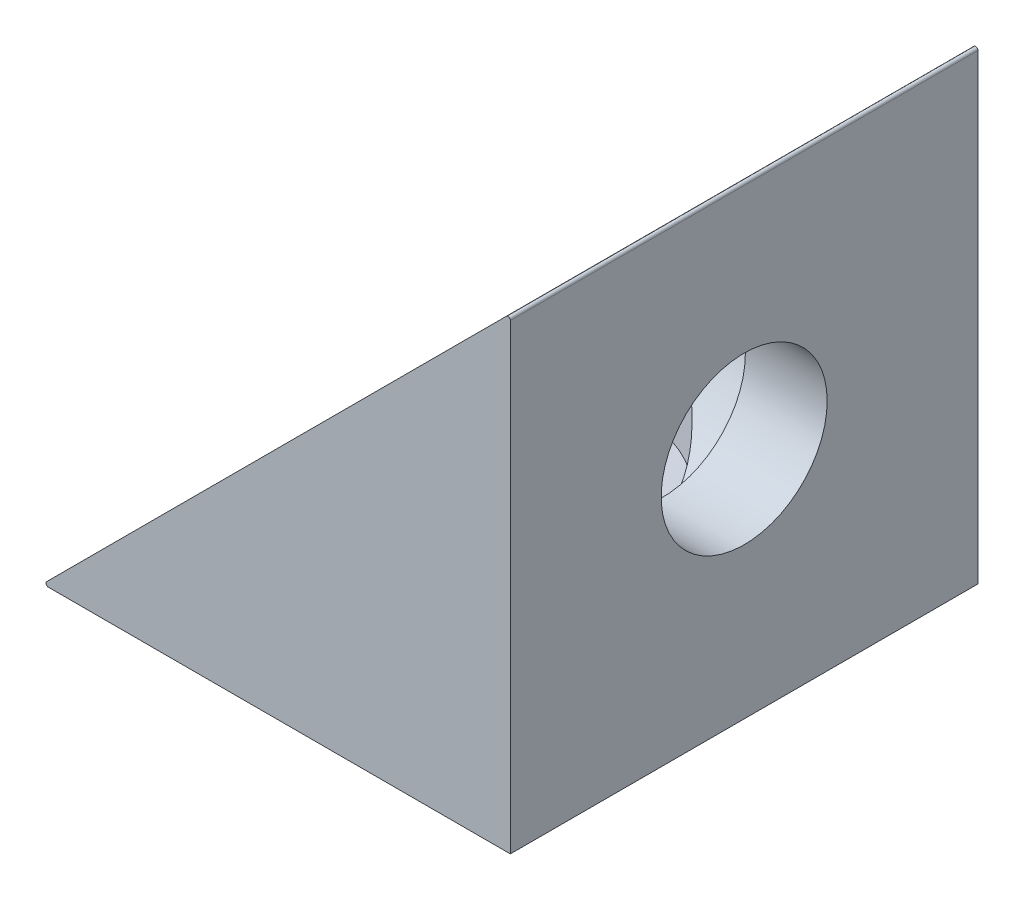
ISO-10303-21;
HEADER;
FILE_DESCRIPTION(('STEP AP214'),'2;1');
FILE_NAME('part.step','',(''),(''),'','','');
FILE_SCHEMA(('AUTOMOTIVE_DESIGN { 1 0 10303 214 1 1 1 1 }'));
ENDSEC;
DATA;
#1=APPLICATION_CONTEXT('core data for automotive mechanical design processes');
#2=APPLICATION_PROTOCOL_DEFINITION('international standard','automotive_design',2000,#1);
#3=PRODUCT_CONTEXT('',#1,'mechanical');
#4=PRODUCT('Part','Part','',(#3));
#5=PRODUCT_RELATED_PRODUCT_CATEGORY('part','',(#4));
#6=PRODUCT_DEFINITION_FORMATION('','',#4);
#7=PRODUCT_DEFINITION_CONTEXT('part definition',#1,'design');
#8=PRODUCT_DEFINITION('design','',#6,#7);
#9=PRODUCT_DEFINITION_SHAPE('','',#8);
#10=(LENGTH_UNIT() NAMED_UNIT(*) SI_UNIT(.MILLI.,.METRE.));
#11=(NAMED_UNIT(*) PLANE_ANGLE_UNIT() SI_UNIT($,.RADIAN.));
#12=(NAMED_UNIT(*) SI_UNIT($,.STERADIAN.) SOLID_ANGLE_UNIT());
#13=UNCERTAINTY_MEASURE_WITH_UNIT(LENGTH_MEASURE(1.E-05),#10,'distance_accuracy_value','');
#14=(GEOMETRIC_REPRESENTATION_CONTEXT(3) GLOBAL_UNCERTAINTY_ASSIGNED_CONTEXT((#13)) GLOBAL_UNIT_ASSIGNED_CONTEXT((#10,
#11,#12)) REPRESENTATION_CONTEXT('',''));
#15=CARTESIAN_POINT('',(0.,0.,0.));
#16=DIRECTION('',(0.,0.,1.));
#17=DIRECTION('',(1.,0.,0.));
#18=AXIS2_PLACEMENT_3D('',#15,#16,#17);
#19=CARTESIAN_POINT('',(0.,-20.,20.));
#20=DIRECTION('',(-1.,0.,0.));
#21=DIRECTION('',(0.,0.,1.));
#22=AXIS2_PLACEMENT_3D('',#19,#20,#21);
#23=PLANE('',#22);
#24=CARTESIAN_POINT('',(0.,-10.,10.));
#25=DIRECTION('',(1.,0.,0.));
#26=DIRECTION('',(0.,0.,-1.));
#27=AXIS2_PLACEMENT_3D('',#24,#25,#26);
#28=CIRCLE('',#27,3.55);
#29=CARTESIAN_POINT('',(0.,-10.,6.45));
#30=VERTEX_POINT('',#29);
#31=EDGE_CURVE('E106',#30,#30,#28,.T.);
#32=ORIENTED_EDGE('',*,*,#31,.F.);
#33=EDGE_LOOP('',(#32));
#34=FACE_BOUND('',#33,.T.);
#35=DIRECTION('',(0.,1.,0.));
#36=VECTOR('',#35,1.);
#37=CARTESIAN_POINT('',(0.,-20.,0.));
#38=LINE('',#37,#36);
#39=CARTESIAN_POINT('',(0.,-20.,0.));
#40=VERTEX_POINT('',#39);
#41=CARTESIAN_POINT('',(0.,-0.241421356237306,0.));
#42=VERTEX_POINT('',#41);
#43=EDGE_CURVE('E116',#40,#42,#38,.T.);
#44=ORIENTED_EDGE('',*,*,#43,.T.);
#45=DIRECTION('',(0.,0.,-1.));
#46=VECTOR('',#45,1.);
#47=CARTESIAN_POINT('',(0.,-0.241421356237306,20.));
#48=LINE('',#47,#46);
#49=CARTESIAN_POINT('',(0.,-0.241421356237306,20.));
#50=VERTEX_POINT('',#49);
#51=EDGE_CURVE('E11',#42,#50,#48,.F.);
#52=ORIENTED_EDGE('',*,*,#51,.T.);
#53=DIRECTION('',(0.,1.,0.));
#54=VECTOR('',#53,1.);
#55=CARTESIAN_POINT('',(0.,-20.,20.));
#56=LINE('',#55,#54);
#57=CARTESIAN_POINT('',(0.,-20.,20.));
#58=VERTEX_POINT('',#57);
#59=EDGE_CURVE('E117',#58,#50,#56,.T.);
#60=ORIENTED_EDGE('',*,*,#59,.F.);
#61=DIRECTION('',(0.,0.,-1.));
#62=VECTOR('',#61,1.);
#63=CARTESIAN_POINT('',(0.,-20.,20.));
#64=LINE('',#63,#62);
#65=EDGE_CURVE('E98',#58,#40,#64,.T.);
#66=ORIENTED_EDGE('',*,*,#65,.T.);
#67=EDGE_LOOP('',(#44,#52,#60,#66));
#68=FACE_BOUND('',#67,.T.);
#69=ADVANCED_FACE('F36',(#34,#68),#23,.F.);
#70=CARTESIAN_POINT('',(-20.,-20.,20.));
#71=DIRECTION('',(0.707106781186548,-0.707106781186548,0.));
#72=DIRECTION('',(0.707106781186548,0.707106781186548,0.));
#73=AXIS2_PLACEMENT_3D('',#70,#71,#72);
#74=PLANE('',#73);
#75=CARTESIAN_POINT('',(-10.,-10.,10.));
#76=DIRECTION('',(0.707106781186548,-0.707106781186548,0.));
#77=DIRECTION('',(0.707106781186548,0.707106781186548,0.));
#78=AXIS2_PLACEMENT_3D('',#75,#76,#77);
#79=ELLIPSE('',#78,7.77817459305202,5.5);
#80=CARTESIAN_POINT('',(-10.,-10.,15.5));
#81=VERTEX_POINT('',#80);
#82=CARTESIAN_POINT('',(-10.,-10.,4.5));
#83=VERTEX_POINT('',#82);
#84=EDGE_CURVE('E94',#81,#83,#79,.T.);
#85=ORIENTED_EDGE('',*,*,#84,.T.);
#86=EDGE_CURVE('E100',#83,#81,#79,.T.);
#87=ORIENTED_EDGE('',*,*,#86,.T.);
#88=EDGE_LOOP('',(#85,#87));
#89=FACE_BOUND('',#88,.T.);
#90=DIRECTION('',(-0.707106781186548,-0.707106781186548,0.));
#91=VECTOR('',#90,1.);
#92=CARTESIAN_POINT('',(-20.,-20.,0.));
#93=LINE('',#92,#91);
#94=CARTESIAN_POINT('',(-0.170710678118653,-0.170710678118653,0.));
#95=VERTEX_POINT('',#94);
#96=CARTESIAN_POINT('',(-19.8292893218813,-19.8292893218813,0.));
#97=VERTEX_POINT('',#96);
#98=EDGE_CURVE('E125',#95,#97,#93,.T.);
#99=ORIENTED_EDGE('',*,*,#98,.T.);
#100=DIRECTION('',(0.,0.,-1.));
#101=VECTOR('',#100,1.);
#102=CARTESIAN_POINT('',(-19.8292893218813,-19.8292893218813,20.));
#103=LINE('',#102,#101);
#104=CARTESIAN_POINT('',(-19.8292893218813,-19.8292893218813,20.));
#105=VERTEX_POINT('',#104);
#106=EDGE_CURVE('E57',#97,#105,#103,.F.);
#107=ORIENTED_EDGE('',*,*,#106,.T.);
#108=DIRECTION('',(-0.707106781186548,-0.707106781186548,0.));
#109=VECTOR('',#108,1.);
#110=CARTESIAN_POINT('',(-20.,-20.,20.));
#111=LINE('',#110,#109);
#112=CARTESIAN_POINT('',(-0.170710678118653,-0.170710678118653,20.));
#113=VERTEX_POINT('',#112);
#114=EDGE_CURVE('E119',#113,#105,#111,.T.);
#115=ORIENTED_EDGE('',*,*,#114,.F.);
#116=DIRECTION('',(0.,0.,-1.));
#117=VECTOR('',#116,1.);
#118=CARTESIAN_POINT('',(-0.170710678118656,-0.170710678118656,20.));
#119=LINE('',#118,#117);
#120=EDGE_CURVE('E142',#113,#95,#119,.T.);
#121=ORIENTED_EDGE('',*,*,#120,.T.);
#122=EDGE_LOOP('',(#99,#107,#115,#121));
#123=FACE_BOUND('',#122,.T.);
#124=ADVANCED_FACE('F105',(#89,#123),#74,.F.);
#125=CARTESIAN_POINT('',(-20.,-20.,20.));
#126=DIRECTION('',(0.,1.,0.));
#127=DIRECTION('',(0.,0.,1.));
#128=AXIS2_PLACEMENT_3D('',#125,#126,#127);
#129=PLANE('',#128);
#130=CARTESIAN_POINT('',(-10.,-20.,10.));
#131=DIRECTION('',(0.,-1.,0.));
#132=DIRECTION('',(0.,0.,-1.));
#133=AXIS2_PLACEMENT_3D('',#130,#131,#132);
#134=CIRCLE('',#133,3.55);
#135=CARTESIAN_POINT('',(-10.,-20.,6.45));
#136=VERTEX_POINT('',#135);
#137=EDGE_CURVE('E108',#136,#136,#134,.T.);
#138=ORIENTED_EDGE('',*,*,#137,.F.);
#139=EDGE_LOOP('',(#138));
#140=FACE_BOUND('',#139,.T.);
#141=DIRECTION('',(1.,0.,0.));
#142=VECTOR('',#141,1.);
#143=CARTESIAN_POINT('',(-20.,-20.,20.));
#144=LINE('',#143,#142);
#145=CARTESIAN_POINT('',(-19.7585786437627,-20.,20.));
#146=VERTEX_POINT('',#145);
#147=EDGE_CURVE('E122',#146,#58,#144,.T.);
#148=ORIENTED_EDGE('',*,*,#147,.F.);
#149=DIRECTION('',(0.,0.,-1.));
#150=VECTOR('',#149,1.);
#151=CARTESIAN_POINT('',(-19.7585786437627,-20.,20.));
#152=LINE('',#151,#150);
#153=CARTESIAN_POINT('',(-19.7585786437627,-20.,0.));
#154=VERTEX_POINT('',#153);
#155=EDGE_CURVE('E97',#146,#154,#152,.T.);
#156=ORIENTED_EDGE('',*,*,#155,.T.);
#157=DIRECTION('',(1.,0.,0.));
#158=VECTOR('',#157,1.);
#159=CARTESIAN_POINT('',(-20.,-20.,0.));
#160=LINE('',#159,#158);
#161=EDGE_CURVE('E120',#154,#40,#160,.T.);
#162=ORIENTED_EDGE('',*,*,#161,.T.);
#163=ORIENTED_EDGE('',*,*,#65,.F.);
#164=EDGE_LOOP('',(#148,#156,#162,#163));
#165=FACE_BOUND('',#164,.T.);
#166=ADVANCED_FACE('F155',(#140,#165),#129,.F.);
#167=CARTESIAN_POINT('',(0.,0.,20.));
#168=DIRECTION('',(0.,0.,-1.));
#169=DIRECTION('',(-1.,0.,0.));
#170=AXIS2_PLACEMENT_3D('',#167,#168,#169);
#171=PLANE('',#170);
#172=ORIENTED_EDGE('',*,*,#114,.T.);
#173=CARTESIAN_POINT('',(-19.7585786437627,-19.9,20.));
#174=DIRECTION('',(0.,0.,-1.));
#175=DIRECTION('',(-1.,0.,0.));
#176=AXIS2_PLACEMENT_3D('',#173,#174,#175);
#177=CIRCLE('',#176,0.1);
#178=EDGE_CURVE('E44',#105,#146,#177,.F.);
#179=ORIENTED_EDGE('',*,*,#178,.T.);
#180=ORIENTED_EDGE('',*,*,#147,.T.);
#181=ORIENTED_EDGE('',*,*,#59,.T.);
#182=CARTESIAN_POINT('',(-0.0999999999999994,-0.241421356237306,20.));
#183=DIRECTION('',(0.,0.,-1.));
#184=DIRECTION('',(-1.,0.,0.));
#185=AXIS2_PLACEMENT_3D('',#182,#183,#184);
#186=CIRCLE('',#185,0.1);
#187=EDGE_CURVE('E146',#50,#113,#186,.F.);
#188=ORIENTED_EDGE('',*,*,#187,.T.);
#189=EDGE_LOOP('',(#172,#179,#180,#181,#188));
#190=FACE_BOUND('',#189,.T.);
#191=ADVANCED_FACE('F150',(#190),#171,.F.);
#192=CARTESIAN_POINT('',(0.,0.,0.));
#193=DIRECTION('',(0.,0.,-1.));
#194=DIRECTION('',(-1.,0.,0.));
#195=AXIS2_PLACEMENT_3D('',#192,#193,#194);
#196=PLANE('',#195);
#197=ORIENTED_EDGE('',*,*,#161,.F.);
#198=CARTESIAN_POINT('',(-19.7585786437627,-19.9,0.));
#199=DIRECTION('',(0.,0.,-1.));
#200=DIRECTION('',(-1.,0.,0.));
#201=AXIS2_PLACEMENT_3D('',#198,#199,#200);
#202=CIRCLE('',#201,0.1);
#203=EDGE_CURVE('E140',#154,#97,#202,.T.);
#204=ORIENTED_EDGE('',*,*,#203,.T.);
#205=ORIENTED_EDGE('',*,*,#98,.F.);
#206=CARTESIAN_POINT('',(-0.0999999999999994,-0.241421356237306,0.));
#207=DIRECTION('',(0.,0.,-1.));
#208=DIRECTION('',(-1.,0.,0.));
#209=AXIS2_PLACEMENT_3D('',#206,#207,#208);
#210=CIRCLE('',#209,0.1);
#211=EDGE_CURVE('E138',#95,#42,#210,.T.);
#212=ORIENTED_EDGE('',*,*,#211,.T.);
#213=ORIENTED_EDGE('',*,*,#43,.F.);
#214=EDGE_LOOP('',(#197,#204,#205,#212,#213));
#215=FACE_BOUND('',#214,.T.);
#216=ADVANCED_FACE('F160',(#215),#196,.T.);
#217=CARTESIAN_POINT('',(-10.,0.,10.));
#218=DIRECTION('',(0.,-1.,0.));
#219=DIRECTION('',(0.,0.,-1.));
#220=AXIS2_PLACEMENT_3D('',#217,#218,#219);
#221=CYLINDRICAL_SURFACE('',#220,3.55);
#222=CARTESIAN_POINT('',(-10.,-16.5,10.));
#223=DIRECTION('',(0.,-1.,0.));
#224=DIRECTION('',(0.,0.,-1.));
#225=AXIS2_PLACEMENT_3D('',#222,#223,#224);
#226=CIRCLE('',#225,3.55);
#227=CARTESIAN_POINT('',(-10.,-16.5,6.45));
#228=VERTEX_POINT('',#227);
#229=EDGE_CURVE('E132',#228,#228,#226,.F.);
#230=ORIENTED_EDGE('',*,*,#229,.T.);
#231=EDGE_LOOP('',(#230));
#232=FACE_BOUND('',#231,.T.);
#233=ORIENTED_EDGE('',*,*,#137,.T.);
#234=EDGE_LOOP('',(#233));
#235=FACE_BOUND('',#234,.T.);
#236=ADVANCED_FACE('F199',(#232,#235),#221,.F.);
#237=CARTESIAN_POINT('',(-20.,-10.,10.));
#238=DIRECTION('',(1.,0.,0.));
#239=DIRECTION('',(0.,0.,-1.));
#240=AXIS2_PLACEMENT_3D('',#237,#238,#239);
#241=CYLINDRICAL_SURFACE('',#240,3.55);
#242=CARTESIAN_POINT('',(-3.5,-10.,10.));
#243=DIRECTION('',(1.,0.,0.));
#244=DIRECTION('',(0.,0.,-1.));
#245=AXIS2_PLACEMENT_3D('',#242,#243,#244);
#246=CIRCLE('',#245,3.55);
#247=CARTESIAN_POINT('',(-3.5,-10.,6.45));
#248=VERTEX_POINT('',#247);
#249=EDGE_CURVE('E103',#248,#248,#246,.F.);
#250=ORIENTED_EDGE('',*,*,#249,.T.);
#251=EDGE_LOOP('',(#250));
#252=FACE_BOUND('',#251,.T.);
#253=ORIENTED_EDGE('',*,*,#31,.T.);
#254=EDGE_LOOP('',(#253));
#255=FACE_BOUND('',#254,.T.);
#256=ADVANCED_FACE('F195',(#252,#255),#241,.F.);
#257=CARTESIAN_POINT('',(-20.,-10.,10.));
#258=DIRECTION('',(1.,0.,0.));
#259=DIRECTION('',(0.,0.,-1.));
#260=AXIS2_PLACEMENT_3D('',#257,#258,#259);
#261=CYLINDRICAL_SURFACE('',#260,5.5);
#262=CARTESIAN_POINT('',(-3.5,-10.,10.));
#263=DIRECTION('',(1.,0.,0.));
#264=DIRECTION('',(0.,0.,-1.));
#265=AXIS2_PLACEMENT_3D('',#262,#263,#264);
#266=CIRCLE('',#265,5.5);
#267=CARTESIAN_POINT('',(-3.5,-10.,4.5));
#268=VERTEX_POINT('',#267);
#269=EDGE_CURVE('E111',#268,#268,#266,.T.);
#270=ORIENTED_EDGE('',*,*,#269,.T.);
#271=EDGE_LOOP('',(#270));
#272=FACE_BOUND('',#271,.T.);
#273=ORIENTED_EDGE('',*,*,#86,.F.);
#274=CARTESIAN_POINT('',(-10.,-10.,10.));
#275=DIRECTION('',(0.707106781186547,0.707106781186547,0.));
#276=DIRECTION('',(0.707106781186547,-0.707106781186547,0.));
#277=AXIS2_PLACEMENT_3D('',#274,#275,#276);
#278=ELLIPSE('',#277,7.77817459305202,5.5);
#279=EDGE_CURVE('E90',#83,#81,#278,.F.);
#280=ORIENTED_EDGE('',*,*,#279,.T.);
#281=EDGE_LOOP('',(#273,#280));
#282=FACE_BOUND('',#281,.T.);
#283=ADVANCED_FACE('F101',(#272,#282),#261,.F.);
#284=CARTESIAN_POINT('',(-3.5,-10.,10.));
#285=DIRECTION('',(1.,0.,0.));
#286=DIRECTION('',(0.,0.,-1.));
#287=AXIS2_PLACEMENT_3D('',#284,#285,#286);
#288=PLANE('',#287);
#289=ORIENTED_EDGE('',*,*,#269,.F.);
#290=EDGE_LOOP('',(#289));
#291=FACE_BOUND('',#290,.T.);
#292=ORIENTED_EDGE('',*,*,#249,.F.);
#293=EDGE_LOOP('',(#292));
#294=FACE_BOUND('',#293,.T.);
#295=ADVANCED_FACE('F185',(#291,#294),#288,.F.);
#296=CARTESIAN_POINT('',(-10.,-16.5,10.));
#297=DIRECTION('',(0.,-1.,0.));
#298=DIRECTION('',(0.,0.,-1.));
#299=AXIS2_PLACEMENT_3D('',#296,#297,#298);
#300=PLANE('',#299);
#301=CARTESIAN_POINT('',(-10.,-16.5,10.));
#302=DIRECTION('',(0.,-1.,0.));
#303=DIRECTION('',(0.,0.,-1.));
#304=AXIS2_PLACEMENT_3D('',#301,#302,#303);
#305=CIRCLE('',#304,5.5);
#306=CARTESIAN_POINT('',(-10.,-16.5,4.5));
#307=VERTEX_POINT('',#306);
#308=EDGE_CURVE('E135',#307,#307,#305,.T.);
#309=ORIENTED_EDGE('',*,*,#308,.F.);
#310=EDGE_LOOP('',(#309));
#311=FACE_BOUND('',#310,.T.);
#312=ORIENTED_EDGE('',*,*,#229,.F.);
#313=EDGE_LOOP('',(#312));
#314=FACE_BOUND('',#313,.T.);
#315=ADVANCED_FACE('F179',(#311,#314),#300,.F.);
#316=CARTESIAN_POINT('',(-10.,0.,10.));
#317=DIRECTION('',(0.,-1.,0.));
#318=DIRECTION('',(0.,0.,-1.));
#319=AXIS2_PLACEMENT_3D('',#316,#317,#318);
#320=CYLINDRICAL_SURFACE('',#319,5.5);
#321=ORIENTED_EDGE('',*,*,#308,.T.);
#322=EDGE_LOOP('',(#321));
#323=FACE_BOUND('',#322,.T.);
#324=ORIENTED_EDGE('',*,*,#279,.F.);
#325=ORIENTED_EDGE('',*,*,#84,.F.);
#326=EDGE_LOOP('',(#324,#325));
#327=FACE_BOUND('',#326,.T.);
#328=ADVANCED_FACE('F92',(#323,#327),#320,.F.);
#329=CARTESIAN_POINT('',(-19.7585786437627,-19.9,20.));
#330=DIRECTION('',(0.,0.,-1.));
#331=DIRECTION('',(-1.,0.,0.));
#332=AXIS2_PLACEMENT_3D('',#329,#330,#331);
#333=CYLINDRICAL_SURFACE('',#332,0.1);
#334=ORIENTED_EDGE('',*,*,#178,.F.);
#335=ORIENTED_EDGE('',*,*,#106,.F.);
#336=ORIENTED_EDGE('',*,*,#203,.F.);
#337=ORIENTED_EDGE('',*,*,#155,.F.);
#338=EDGE_LOOP('',(#334,#335,#336,#337));
#339=FACE_BOUND('',#338,.T.);
#340=ADVANCED_FACE('F157',(#339),#333,.T.);
#341=CARTESIAN_POINT('',(-0.0999999999999994,-0.241421356237306,20.));
#342=DIRECTION('',(0.,0.,-1.));
#343=DIRECTION('',(-1.,0.,0.));
#344=AXIS2_PLACEMENT_3D('',#341,#342,#343);
#345=CYLINDRICAL_SURFACE('',#344,0.1);
#346=ORIENTED_EDGE('',*,*,#187,.F.);
#347=ORIENTED_EDGE('',*,*,#51,.F.);
#348=ORIENTED_EDGE('',*,*,#211,.F.);
#349=ORIENTED_EDGE('',*,*,#120,.F.);
#350=EDGE_LOOP('',(#346,#347,#348,#349));
#351=FACE_BOUND('',#350,.T.);
#352=ADVANCED_FACE('F38',(#351),#345,.T.);
#353=CLOSED_SHELL('',(#69,#124,#166,#191,#216,#236,#256,#283,#295,#315,#328,#340,#352));
#354=MANIFOLD_SOLID_BREP('B2',#353);
#355=ADVANCED_BREP_SHAPE_REPRESENTATION('',(#18,#354),#14);
#356=SHAPE_DEFINITION_REPRESENTATION(#9,#355);
ENDSEC;
END-ISO-10303-21;
